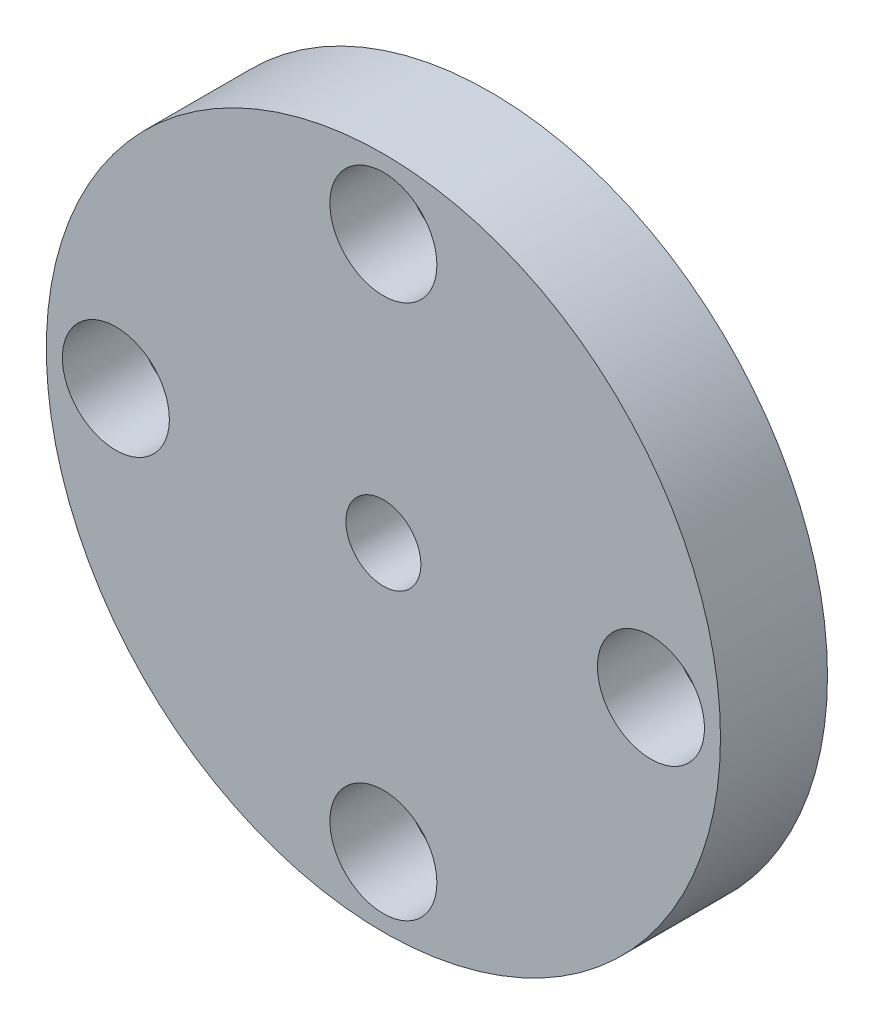
ISO-10303-21;
HEADER;
FILE_DESCRIPTION(('STEP AP214'),'2;1');
FILE_NAME('part.step','',(''),(''),'','','');
FILE_SCHEMA(('AUTOMOTIVE_DESIGN { 1 0 10303 214 1 1 1 1 }'));
ENDSEC;
DATA;
#1=APPLICATION_CONTEXT('core data for automotive mechanical design processes');
#2=APPLICATION_PROTOCOL_DEFINITION('international standard','automotive_design',2000,#1);
#3=PRODUCT_CONTEXT('',#1,'mechanical');
#4=PRODUCT('Part','Part','',(#3));
#5=PRODUCT_RELATED_PRODUCT_CATEGORY('part','',(#4));
#6=PRODUCT_DEFINITION_FORMATION('','',#4);
#7=PRODUCT_DEFINITION_CONTEXT('part definition',#1,'design');
#8=PRODUCT_DEFINITION('design','',#6,#7);
#9=PRODUCT_DEFINITION_SHAPE('','',#8);
#10=(LENGTH_UNIT() NAMED_UNIT(*) SI_UNIT(.MILLI.,.METRE.));
#11=(NAMED_UNIT(*) PLANE_ANGLE_UNIT() SI_UNIT($,.RADIAN.));
#12=(NAMED_UNIT(*) SI_UNIT($,.STERADIAN.) SOLID_ANGLE_UNIT());
#13=UNCERTAINTY_MEASURE_WITH_UNIT(LENGTH_MEASURE(1.E-05),#10,'distance_accuracy_value','');
#14=(GEOMETRIC_REPRESENTATION_CONTEXT(3) GLOBAL_UNCERTAINTY_ASSIGNED_CONTEXT((#13)) GLOBAL_UNIT_ASSIGNED_CONTEXT((#10,
#11,#12)) REPRESENTATION_CONTEXT('',''));
#15=CARTESIAN_POINT('',(0.,0.,0.));
#16=DIRECTION('',(0.,0.,1.));
#17=DIRECTION('',(1.,0.,0.));
#18=AXIS2_PLACEMENT_3D('',#15,#16,#17);
#19=CARTESIAN_POINT('',(0.,0.,0.));
#20=DIRECTION('',(0.,0.,1.));
#21=DIRECTION('',(1.,0.,0.));
#22=AXIS2_PLACEMENT_3D('',#19,#20,#21);
#23=PLANE('',#22);
#24=CARTESIAN_POINT('',(0.,25.,0.));
#25=DIRECTION('',(0.,0.,1.));
#26=DIRECTION('',(1.,0.,0.));
#27=AXIS2_PLACEMENT_3D('',#24,#25,#26);
#28=CIRCLE('',#27,3.);
#29=CARTESIAN_POINT('',(3.,25.,0.));
#30=VERTEX_POINT('',#29);
#31=EDGE_CURVE('E135',#30,#30,#28,.T.);
#32=ORIENTED_EDGE('',*,*,#31,.T.);
#33=EDGE_LOOP('',(#32));
#34=FACE_BOUND('',#33,.T.);
#35=CARTESIAN_POINT('',(25.,0.,0.));
#36=DIRECTION('',(0.,0.,1.));
#37=DIRECTION('',(1.,0.,0.));
#38=AXIS2_PLACEMENT_3D('',#35,#36,#37);
#39=CIRCLE('',#38,3.);
#40=CARTESIAN_POINT('',(28.,0.,0.));
#41=VERTEX_POINT('',#40);
#42=EDGE_CURVE('E89',#41,#41,#39,.F.);
#43=ORIENTED_EDGE('',*,*,#42,.F.);
#44=EDGE_LOOP('',(#43));
#45=FACE_BOUND('',#44,.T.);
#46=CARTESIAN_POINT('',(0.,-25.,0.));
#47=DIRECTION('',(0.,0.,1.));
#48=DIRECTION('',(1.,0.,0.));
#49=AXIS2_PLACEMENT_3D('',#46,#47,#48);
#50=CIRCLE('',#49,3.);
#51=CARTESIAN_POINT('',(3.00000000000001,-25.,0.));
#52=VERTEX_POINT('',#51);
#53=EDGE_CURVE('E119',#52,#52,#50,.F.);
#54=ORIENTED_EDGE('',*,*,#53,.F.);
#55=EDGE_LOOP('',(#54));
#56=FACE_BOUND('',#55,.T.);
#57=CARTESIAN_POINT('',(0.,0.,0.));
#58=DIRECTION('',(0.,0.,1.));
#59=DIRECTION('',(1.,0.,0.));
#60=AXIS2_PLACEMENT_3D('',#57,#58,#59);
#61=CIRCLE('',#60,15.5);
#62=CARTESIAN_POINT('',(15.5,0.,0.));
#63=VERTEX_POINT('',#62);
#64=EDGE_CURVE('E68',#63,#63,#61,.T.);
#65=ORIENTED_EDGE('',*,*,#64,.T.);
#66=EDGE_LOOP('',(#65));
#67=FACE_BOUND('',#66,.T.);
#68=CARTESIAN_POINT('',(0.,0.,0.));
#69=DIRECTION('',(0.,0.,1.));
#70=DIRECTION('',(1.,0.,0.));
#71=AXIS2_PLACEMENT_3D('',#68,#69,#70);
#72=CIRCLE('',#71,31.5);
#73=CARTESIAN_POINT('',(31.5,0.,0.));
#74=VERTEX_POINT('',#73);
#75=EDGE_CURVE('E60',#74,#74,#72,.T.);
#76=ORIENTED_EDGE('',*,*,#75,.F.);
#77=EDGE_LOOP('',(#76));
#78=FACE_BOUND('',#77,.T.);
#79=CARTESIAN_POINT('',(-25.,0.,0.));
#80=DIRECTION('',(0.,0.,1.));
#81=DIRECTION('',(1.,0.,0.));
#82=AXIS2_PLACEMENT_3D('',#79,#80,#81);
#83=CIRCLE('',#82,3.);
#84=CARTESIAN_POINT('',(-22.,0.,0.));
#85=VERTEX_POINT('',#84);
#86=EDGE_CURVE('E127',#85,#85,#83,.T.);
#87=ORIENTED_EDGE('',*,*,#86,.T.);
#88=EDGE_LOOP('',(#87));
#89=FACE_BOUND('',#88,.T.);
#90=ADVANCED_FACE('F51',(#34,#45,#56,#67,#78,#89),#23,.F.);
#91=CARTESIAN_POINT('',(0.,0.,10.));
#92=DIRECTION('',(0.,0.,1.));
#93=DIRECTION('',(1.,0.,0.));
#94=AXIS2_PLACEMENT_3D('',#91,#92,#93);
#95=PLANE('',#94);
#96=CARTESIAN_POINT('',(0.,0.,10.));
#97=DIRECTION('',(0.,0.,1.));
#98=DIRECTION('',(1.,0.,0.));
#99=AXIS2_PLACEMENT_3D('',#96,#97,#98);
#100=CIRCLE('',#99,31.5);
#101=CARTESIAN_POINT('',(31.5,0.,10.));
#102=VERTEX_POINT('',#101);
#103=EDGE_CURVE('E11',#102,#102,#100,.T.);
#104=ORIENTED_EDGE('',*,*,#103,.T.);
#105=EDGE_LOOP('',(#104));
#106=FACE_BOUND('',#105,.T.);
#107=CARTESIAN_POINT('',(0.,0.,10.));
#108=DIRECTION('',(0.,0.,-1.));
#109=DIRECTION('',(-1.,0.,0.));
#110=AXIS2_PLACEMENT_3D('',#107,#108,#109);
#111=CIRCLE('',#110,3.5);
#112=CARTESIAN_POINT('',(-3.5,0.,10.));
#113=VERTEX_POINT('',#112);
#114=EDGE_CURVE('E72',#113,#113,#111,.T.);
#115=ORIENTED_EDGE('',*,*,#114,.T.);
#116=EDGE_LOOP('',(#115));
#117=FACE_BOUND('',#116,.T.);
#118=CARTESIAN_POINT('',(25.,0.,10.));
#119=DIRECTION('',(0.,0.,-1.));
#120=DIRECTION('',(-1.,0.,0.));
#121=AXIS2_PLACEMENT_3D('',#118,#119,#120);
#122=CIRCLE('',#121,5.);
#123=CARTESIAN_POINT('',(20.,0.,10.));
#124=VERTEX_POINT('',#123);
#125=EDGE_CURVE('E88',#124,#124,#122,.T.);
#126=ORIENTED_EDGE('',*,*,#125,.T.);
#127=EDGE_LOOP('',(#126));
#128=FACE_BOUND('',#127,.T.);
#129=CARTESIAN_POINT('',(0.,-25.,10.));
#130=DIRECTION('',(0.,0.,1.));
#131=DIRECTION('',(1.,0.,0.));
#132=AXIS2_PLACEMENT_3D('',#129,#130,#131);
#133=CIRCLE('',#132,5.);
#134=CARTESIAN_POINT('',(5.,-25.,10.));
#135=VERTEX_POINT('',#134);
#136=EDGE_CURVE('E97',#135,#135,#133,.F.);
#137=ORIENTED_EDGE('',*,*,#136,.T.);
#138=EDGE_LOOP('',(#137));
#139=FACE_BOUND('',#138,.T.);
#140=CARTESIAN_POINT('',(0.,25.,10.));
#141=DIRECTION('',(0.,0.,1.));
#142=DIRECTION('',(1.,0.,0.));
#143=AXIS2_PLACEMENT_3D('',#140,#141,#142);
#144=CIRCLE('',#143,5.);
#145=CARTESIAN_POINT('',(5.,25.,10.));
#146=VERTEX_POINT('',#145);
#147=EDGE_CURVE('E105',#146,#146,#144,.T.);
#148=ORIENTED_EDGE('',*,*,#147,.F.);
#149=EDGE_LOOP('',(#148));
#150=FACE_BOUND('',#149,.T.);
#151=CARTESIAN_POINT('',(-25.,0.,10.));
#152=DIRECTION('',(0.,0.,1.));
#153=DIRECTION('',(1.,0.,0.));
#154=AXIS2_PLACEMENT_3D('',#151,#152,#153);
#155=CIRCLE('',#154,5.);
#156=CARTESIAN_POINT('',(-20.,0.,10.));
#157=VERTEX_POINT('',#156);
#158=EDGE_CURVE('E109',#157,#157,#155,.T.);
#159=ORIENTED_EDGE('',*,*,#158,.F.);
#160=EDGE_LOOP('',(#159));
#161=FACE_BOUND('',#160,.T.);
#162=ADVANCED_FACE('F165',(#106,#117,#128,#139,#150,#161),#95,.T.);
#163=CARTESIAN_POINT('',(0.,0.,10.));
#164=DIRECTION('',(0.,0.,-1.));
#165=DIRECTION('',(-1.,0.,0.));
#166=AXIS2_PLACEMENT_3D('',#163,#164,#165);
#167=CYLINDRICAL_SURFACE('',#166,31.5);
#168=ORIENTED_EDGE('',*,*,#103,.F.);
#169=EDGE_LOOP('',(#168));
#170=FACE_BOUND('',#169,.T.);
#171=ORIENTED_EDGE('',*,*,#75,.T.);
#172=EDGE_LOOP('',(#171));
#173=FACE_BOUND('',#172,.T.);
#174=ADVANCED_FACE('F53',(#170,#173),#167,.T.);
#175=CARTESIAN_POINT('',(0.,0.,-4.));
#176=DIRECTION('',(0.,0.,1.));
#177=DIRECTION('',(1.,0.,0.));
#178=AXIS2_PLACEMENT_3D('',#175,#176,#177);
#179=CYLINDRICAL_SURFACE('',#178,15.5);
#180=CARTESIAN_POINT('',(0.,0.,-4.));
#181=DIRECTION('',(0.,0.,1.));
#182=DIRECTION('',(1.,0.,0.));
#183=AXIS2_PLACEMENT_3D('',#180,#181,#182);
#184=CIRCLE('',#183,15.5);
#185=CARTESIAN_POINT('',(15.5,0.,-4.));
#186=VERTEX_POINT('',#185);
#187=EDGE_CURVE('E66',#186,#186,#184,.T.);
#188=ORIENTED_EDGE('',*,*,#187,.T.);
#189=EDGE_LOOP('',(#188));
#190=FACE_BOUND('',#189,.T.);
#191=ORIENTED_EDGE('',*,*,#64,.F.);
#192=EDGE_LOOP('',(#191));
#193=FACE_BOUND('',#192,.T.);
#194=ADVANCED_FACE('F173',(#190,#193),#179,.T.);
#195=CARTESIAN_POINT('',(0.,0.,-4.));
#196=DIRECTION('',(0.,0.,1.));
#197=DIRECTION('',(1.,0.,0.));
#198=AXIS2_PLACEMENT_3D('',#195,#196,#197);
#199=PLANE('',#198);
#200=CARTESIAN_POINT('',(0.,0.,-4.));
#201=DIRECTION('',(0.,0.,-1.));
#202=DIRECTION('',(-1.,0.,0.));
#203=AXIS2_PLACEMENT_3D('',#200,#201,#202);
#204=CIRCLE('',#203,3.5);
#205=CARTESIAN_POINT('',(-3.5,0.,-4.));
#206=VERTEX_POINT('',#205);
#207=EDGE_CURVE('E76',#206,#206,#204,.T.);
#208=ORIENTED_EDGE('',*,*,#207,.F.);
#209=EDGE_LOOP('',(#208));
#210=FACE_BOUND('',#209,.T.);
#211=ORIENTED_EDGE('',*,*,#187,.F.);
#212=EDGE_LOOP('',(#211));
#213=FACE_BOUND('',#212,.T.);
#214=ADVANCED_FACE('F176',(#210,#213),#199,.F.);
#215=CARTESIAN_POINT('',(0.,0.,10.));
#216=DIRECTION('',(0.,0.,-1.));
#217=DIRECTION('',(-1.,0.,0.));
#218=AXIS2_PLACEMENT_3D('',#215,#216,#217);
#219=CYLINDRICAL_SURFACE('',#218,3.5);
#220=ORIENTED_EDGE('',*,*,#114,.F.);
#221=EDGE_LOOP('',(#220));
#222=FACE_BOUND('',#221,.T.);
#223=ORIENTED_EDGE('',*,*,#207,.T.);
#224=EDGE_LOOP('',(#223));
#225=FACE_BOUND('',#224,.T.);
#226=ADVANCED_FACE('F180',(#222,#225),#219,.F.);
#227=CARTESIAN_POINT('',(25.,0.,3.));
#228=DIRECTION('',(0.,0.,1.));
#229=DIRECTION('',(1.,0.,0.));
#230=AXIS2_PLACEMENT_3D('',#227,#228,#229);
#231=CYLINDRICAL_SURFACE('',#230,5.);
#232=ORIENTED_EDGE('',*,*,#125,.F.);
#233=EDGE_LOOP('',(#232));
#234=FACE_BOUND('',#233,.T.);
#235=CARTESIAN_POINT('',(25.,0.,3.));
#236=DIRECTION('',(0.,0.,-1.));
#237=DIRECTION('',(-1.,0.,0.));
#238=AXIS2_PLACEMENT_3D('',#235,#236,#237);
#239=CIRCLE('',#238,5.);
#240=CARTESIAN_POINT('',(20.,0.,3.));
#241=VERTEX_POINT('',#240);
#242=EDGE_CURVE('E84',#241,#241,#239,.T.);
#243=ORIENTED_EDGE('',*,*,#242,.T.);
#244=EDGE_LOOP('',(#243));
#245=FACE_BOUND('',#244,.T.);
#246=ADVANCED_FACE('F184',(#234,#245),#231,.F.);
#247=CARTESIAN_POINT('',(0.,0.,3.));
#248=DIRECTION('',(0.,0.,1.));
#249=DIRECTION('',(1.,0.,0.));
#250=AXIS2_PLACEMENT_3D('',#247,#248,#249);
#251=PLANE('',#250);
#252=CARTESIAN_POINT('',(25.,0.,3.));
#253=DIRECTION('',(0.,0.,1.));
#254=DIRECTION('',(1.,0.,0.));
#255=AXIS2_PLACEMENT_3D('',#252,#253,#254);
#256=CIRCLE('',#255,3.);
#257=CARTESIAN_POINT('',(28.,0.,3.));
#258=VERTEX_POINT('',#257);
#259=EDGE_CURVE('E55',#258,#258,#256,.F.);
#260=ORIENTED_EDGE('',*,*,#259,.T.);
#261=EDGE_LOOP('',(#260));
#262=FACE_BOUND('',#261,.T.);
#263=ORIENTED_EDGE('',*,*,#242,.F.);
#264=EDGE_LOOP('',(#263));
#265=FACE_BOUND('',#264,.T.);
#266=ADVANCED_FACE('F186',(#262,#265),#251,.T.);
#267=CARTESIAN_POINT('',(0.,-25.,3.));
#268=DIRECTION('',(0.,0.,1.));
#269=DIRECTION('',(1.,0.,0.));
#270=AXIS2_PLACEMENT_3D('',#267,#268,#269);
#271=CYLINDRICAL_SURFACE('',#270,5.);
#272=CARTESIAN_POINT('',(0.,-25.,3.));
#273=DIRECTION('',(0.,0.,1.));
#274=DIRECTION('',(1.,0.,0.));
#275=AXIS2_PLACEMENT_3D('',#272,#273,#274);
#276=CIRCLE('',#275,5.);
#277=CARTESIAN_POINT('',(5.,-25.,3.));
#278=VERTEX_POINT('',#277);
#279=EDGE_CURVE('E93',#278,#278,#276,.F.);
#280=ORIENTED_EDGE('',*,*,#279,.T.);
#281=EDGE_LOOP('',(#280));
#282=FACE_BOUND('',#281,.T.);
#283=ORIENTED_EDGE('',*,*,#136,.F.);
#284=EDGE_LOOP('',(#283));
#285=FACE_BOUND('',#284,.T.);
#286=ADVANCED_FACE('F189',(#282,#285),#271,.F.);
#287=CARTESIAN_POINT('',(0.,0.,3.));
#288=DIRECTION('',(0.,0.,1.));
#289=DIRECTION('',(1.,0.,0.));
#290=AXIS2_PLACEMENT_3D('',#287,#288,#289);
#291=PLANE('',#290);
#292=CARTESIAN_POINT('',(0.,-25.,3.));
#293=DIRECTION('',(0.,0.,1.));
#294=DIRECTION('',(1.,0.,0.));
#295=AXIS2_PLACEMENT_3D('',#292,#293,#294);
#296=CIRCLE('',#295,3.);
#297=CARTESIAN_POINT('',(3.00000000000001,-25.,3.));
#298=VERTEX_POINT('',#297);
#299=EDGE_CURVE('E123',#298,#298,#296,.F.);
#300=ORIENTED_EDGE('',*,*,#299,.T.);
#301=EDGE_LOOP('',(#300));
#302=FACE_BOUND('',#301,.T.);
#303=ORIENTED_EDGE('',*,*,#279,.F.);
#304=EDGE_LOOP('',(#303));
#305=FACE_BOUND('',#304,.T.);
#306=ADVANCED_FACE('F160',(#302,#305),#291,.T.);
#307=CARTESIAN_POINT('',(0.,25.,3.));
#308=DIRECTION('',(0.,0.,1.));
#309=DIRECTION('',(1.,0.,0.));
#310=AXIS2_PLACEMENT_3D('',#307,#308,#309);
#311=CYLINDRICAL_SURFACE('',#310,5.);
#312=CARTESIAN_POINT('',(0.,25.,3.));
#313=DIRECTION('',(0.,0.,1.));
#314=DIRECTION('',(1.,0.,0.));
#315=AXIS2_PLACEMENT_3D('',#312,#313,#314);
#316=CIRCLE('',#315,5.);
#317=CARTESIAN_POINT('',(5.,25.,3.));
#318=VERTEX_POINT('',#317);
#319=EDGE_CURVE('E101',#318,#318,#316,.T.);
#320=ORIENTED_EDGE('',*,*,#319,.F.);
#321=EDGE_LOOP('',(#320));
#322=FACE_BOUND('',#321,.T.);
#323=ORIENTED_EDGE('',*,*,#147,.T.);
#324=EDGE_LOOP('',(#323));
#325=FACE_BOUND('',#324,.T.);
#326=ADVANCED_FACE('F150',(#322,#325),#311,.F.);
#327=CARTESIAN_POINT('',(0.,0.,3.));
#328=DIRECTION('',(0.,0.,1.));
#329=DIRECTION('',(1.,0.,0.));
#330=AXIS2_PLACEMENT_3D('',#327,#328,#329);
#331=PLANE('',#330);
#332=ORIENTED_EDGE('',*,*,#319,.T.);
#333=EDGE_LOOP('',(#332));
#334=FACE_BOUND('',#333,.T.);
#335=CARTESIAN_POINT('',(0.,25.,3.));
#336=DIRECTION('',(0.,0.,1.));
#337=DIRECTION('',(1.,0.,0.));
#338=AXIS2_PLACEMENT_3D('',#335,#336,#337);
#339=CIRCLE('',#338,3.);
#340=CARTESIAN_POINT('',(3.,25.,3.));
#341=VERTEX_POINT('',#340);
#342=EDGE_CURVE('E139',#341,#341,#339,.T.);
#343=ORIENTED_EDGE('',*,*,#342,.F.);
#344=EDGE_LOOP('',(#343));
#345=FACE_BOUND('',#344,.T.);
#346=ADVANCED_FACE('F147',(#334,#345),#331,.T.);
#347=CARTESIAN_POINT('',(-25.,0.,3.));
#348=DIRECTION('',(0.,0.,1.));
#349=DIRECTION('',(1.,0.,0.));
#350=AXIS2_PLACEMENT_3D('',#347,#348,#349);
#351=CYLINDRICAL_SURFACE('',#350,5.);
#352=CARTESIAN_POINT('',(-25.,0.,3.));
#353=DIRECTION('',(0.,0.,1.));
#354=DIRECTION('',(1.,0.,0.));
#355=AXIS2_PLACEMENT_3D('',#352,#353,#354);
#356=CIRCLE('',#355,5.);
#357=CARTESIAN_POINT('',(-20.,0.,3.));
#358=VERTEX_POINT('',#357);
#359=EDGE_CURVE('E80',#358,#358,#356,.T.);
#360=ORIENTED_EDGE('',*,*,#359,.F.);
#361=EDGE_LOOP('',(#360));
#362=FACE_BOUND('',#361,.T.);
#363=ORIENTED_EDGE('',*,*,#158,.T.);
#364=EDGE_LOOP('',(#363));
#365=FACE_BOUND('',#364,.T.);
#366=ADVANCED_FACE('F149',(#362,#365),#351,.F.);
#367=CARTESIAN_POINT('',(0.,0.,3.));
#368=DIRECTION('',(0.,0.,1.));
#369=DIRECTION('',(1.,0.,0.));
#370=AXIS2_PLACEMENT_3D('',#367,#368,#369);
#371=PLANE('',#370);
#372=CARTESIAN_POINT('',(-25.,0.,3.));
#373=DIRECTION('',(0.,0.,1.));
#374=DIRECTION('',(1.,0.,0.));
#375=AXIS2_PLACEMENT_3D('',#372,#373,#374);
#376=CIRCLE('',#375,3.);
#377=CARTESIAN_POINT('',(-22.,0.,3.));
#378=VERTEX_POINT('',#377);
#379=EDGE_CURVE('E131',#378,#378,#376,.T.);
#380=ORIENTED_EDGE('',*,*,#379,.F.);
#381=EDGE_LOOP('',(#380));
#382=FACE_BOUND('',#381,.T.);
#383=ORIENTED_EDGE('',*,*,#359,.T.);
#384=EDGE_LOOP('',(#383));
#385=FACE_BOUND('',#384,.T.);
#386=ADVANCED_FACE('F157',(#382,#385),#371,.T.);
#387=CARTESIAN_POINT('',(-25.,0.,-4.));
#388=DIRECTION('',(0.,0.,1.));
#389=DIRECTION('',(1.,0.,0.));
#390=AXIS2_PLACEMENT_3D('',#387,#388,#389);
#391=CYLINDRICAL_SURFACE('',#390,3.);
#392=ORIENTED_EDGE('',*,*,#379,.T.);
#393=EDGE_LOOP('',(#392));
#394=FACE_BOUND('',#393,.T.);
#395=ORIENTED_EDGE('',*,*,#86,.F.);
#396=EDGE_LOOP('',(#395));
#397=FACE_BOUND('',#396,.T.);
#398=ADVANCED_FACE('F242',(#394,#397),#391,.F.);
#399=CARTESIAN_POINT('',(0.,25.,-4.));
#400=DIRECTION('',(0.,0.,1.));
#401=DIRECTION('',(1.,0.,0.));
#402=AXIS2_PLACEMENT_3D('',#399,#400,#401);
#403=CYLINDRICAL_SURFACE('',#402,3.);
#404=ORIENTED_EDGE('',*,*,#342,.T.);
#405=EDGE_LOOP('',(#404));
#406=FACE_BOUND('',#405,.T.);
#407=ORIENTED_EDGE('',*,*,#31,.F.);
#408=EDGE_LOOP('',(#407));
#409=FACE_BOUND('',#408,.T.);
#410=ADVANCED_FACE('F144',(#406,#409),#403,.F.);
#411=CARTESIAN_POINT('',(0.,-25.,-4.));
#412=DIRECTION('',(0.,0.,1.));
#413=DIRECTION('',(1.,0.,0.));
#414=AXIS2_PLACEMENT_3D('',#411,#412,#413);
#415=CYLINDRICAL_SURFACE('',#414,3.);
#416=ORIENTED_EDGE('',*,*,#299,.F.);
#417=EDGE_LOOP('',(#416));
#418=FACE_BOUND('',#417,.T.);
#419=ORIENTED_EDGE('',*,*,#53,.T.);
#420=EDGE_LOOP('',(#419));
#421=FACE_BOUND('',#420,.T.);
#422=ADVANCED_FACE('F271',(#418,#421),#415,.F.);
#423=CARTESIAN_POINT('',(25.,0.,-4.));
#424=DIRECTION('',(0.,0.,1.));
#425=DIRECTION('',(1.,0.,0.));
#426=AXIS2_PLACEMENT_3D('',#423,#424,#425);
#427=CYLINDRICAL_SURFACE('',#426,3.);
#428=ORIENTED_EDGE('',*,*,#259,.F.);
#429=EDGE_LOOP('',(#428));
#430=FACE_BOUND('',#429,.T.);
#431=ORIENTED_EDGE('',*,*,#42,.T.);
#432=EDGE_LOOP('',(#431));
#433=FACE_BOUND('',#432,.T.);
#434=ADVANCED_FACE('F280',(#430,#433),#427,.F.);
#435=CLOSED_SHELL('',(#90,#162,#174,#194,#214,#226,#246,#266,#286,#306,#326,#346,#366,#386,#398,
#410,#422,#434));
#436=MANIFOLD_SOLID_BREP('B2',#435);
#437=ADVANCED_BREP_SHAPE_REPRESENTATION('',(#18,#436),#14);
#438=SHAPE_DEFINITION_REPRESENTATION(#9,#437);
ENDSEC;
END-ISO-10303-21;
